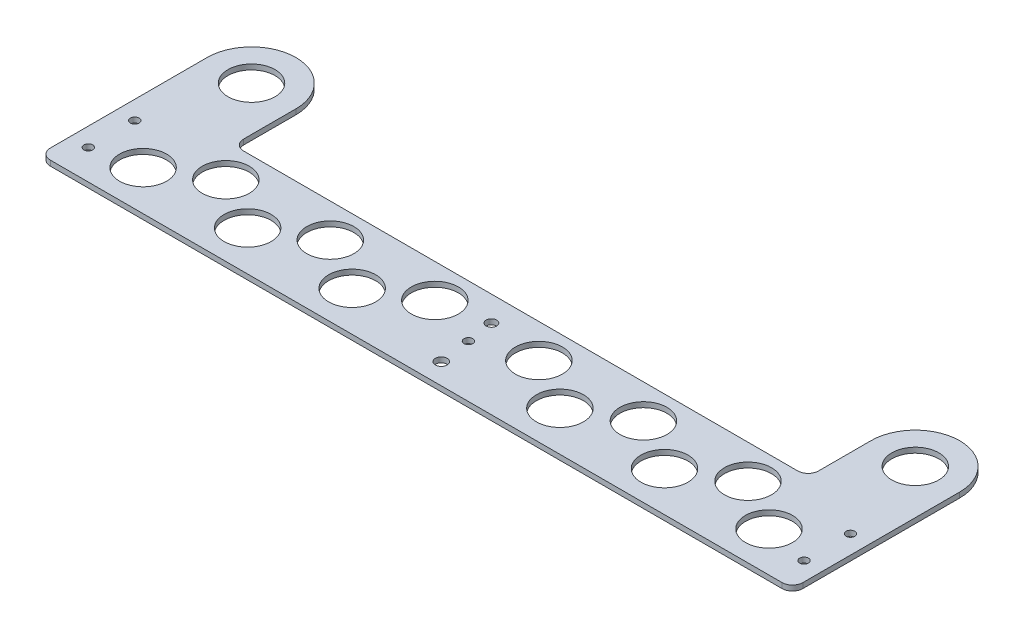
ISO-10303-21;
HEADER;
FILE_DESCRIPTION(('STEP AP214'),'2;1');
FILE_NAME('part.step','',(''),(''),'','','');
FILE_SCHEMA(('AUTOMOTIVE_DESIGN { 1 0 10303 214 1 1 1 1 }'));
ENDSEC;
DATA;
#1=APPLICATION_CONTEXT('core data for automotive mechanical design processes');
#2=APPLICATION_PROTOCOL_DEFINITION('international standard','automotive_design',2000,#1);
#3=PRODUCT_CONTEXT('',#1,'mechanical');
#4=PRODUCT('Part','Part','',(#3));
#5=PRODUCT_RELATED_PRODUCT_CATEGORY('part','',(#4));
#6=PRODUCT_DEFINITION_FORMATION('','',#4);
#7=PRODUCT_DEFINITION_CONTEXT('part definition',#1,'design');
#8=PRODUCT_DEFINITION('design','',#6,#7);
#9=PRODUCT_DEFINITION_SHAPE('','',#8);
#10=(LENGTH_UNIT() NAMED_UNIT(*) SI_UNIT(.MILLI.,.METRE.));
#11=(NAMED_UNIT(*) PLANE_ANGLE_UNIT() SI_UNIT($,.RADIAN.));
#12=(NAMED_UNIT(*) SI_UNIT($,.STERADIAN.) SOLID_ANGLE_UNIT());
#13=UNCERTAINTY_MEASURE_WITH_UNIT(LENGTH_MEASURE(1.E-05),#10,'distance_accuracy_value','');
#14=(GEOMETRIC_REPRESENTATION_CONTEXT(3) GLOBAL_UNCERTAINTY_ASSIGNED_CONTEXT((#13)) GLOBAL_UNIT_ASSIGNED_CONTEXT((#10,
#11,#12)) REPRESENTATION_CONTEXT('',''));
#15=CARTESIAN_POINT('',(0.,0.,0.));
#16=DIRECTION('',(0.,0.,1.));
#17=DIRECTION('',(1.,0.,0.));
#18=AXIS2_PLACEMENT_3D('',#15,#16,#17);
#19=CARTESIAN_POINT('',(0.,3.175,0.));
#20=DIRECTION('',(0.,1.,0.));
#21=DIRECTION('',(0.,0.,1.));
#22=AXIS2_PLACEMENT_3D('',#19,#20,#21);
#23=PLANE('',#22);
#24=CARTESIAN_POINT('',(11.5016714137539,3.175,77.3671745201341));
#25=DIRECTION('',(0.,1.,0.));
#26=DIRECTION('',(0.,0.,1.));
#27=AXIS2_PLACEMENT_3D('',#24,#25,#26);
#28=CIRCLE('',#27,14.2875);
#29=CARTESIAN_POINT('',(11.5016714137539,3.175,91.6546745201341));
#30=VERTEX_POINT('',#29);
#31=EDGE_CURVE('E357',#30,#30,#28,.T.);
#32=ORIENTED_EDGE('',*,*,#31,.F.);
#33=EDGE_LOOP('',(#32));
#34=FACE_BOUND('',#33,.T.);
#35=CARTESIAN_POINT('',(43.0029040562943,3.175,58.6359686154765));
#36=DIRECTION('',(0.,1.,0.));
#37=DIRECTION('',(0.,0.,1.));
#38=AXIS2_PLACEMENT_3D('',#35,#36,#37);
#39=CIRCLE('',#38,14.2875);
#40=CARTESIAN_POINT('',(43.0029040562943,3.175,72.9234686154765));
#41=VERTEX_POINT('',#40);
#42=EDGE_CURVE('E369',#41,#41,#39,.T.);
#43=ORIENTED_EDGE('',*,*,#42,.F.);
#44=EDGE_LOOP('',(#43));
#45=FACE_BOUND('',#44,.T.);
#46=CARTESIAN_POINT('',(75.0016714137539,3.175,77.3671745201341));
#47=DIRECTION('',(0.,1.,0.));
#48=DIRECTION('',(0.,0.,1.));
#49=AXIS2_PLACEMENT_3D('',#46,#47,#48);
#50=CIRCLE('',#49,14.2875);
#51=CARTESIAN_POINT('',(75.0016714137539,3.175,91.6546745201341));
#52=VERTEX_POINT('',#51);
#53=EDGE_CURVE('E375',#52,#52,#50,.T.);
#54=ORIENTED_EDGE('',*,*,#53,.F.);
#55=EDGE_LOOP('',(#54));
#56=FACE_BOUND('',#55,.T.);
#57=CARTESIAN_POINT('',(106.502904056294,3.175,58.6359686154765));
#58=DIRECTION('',(0.,1.,0.));
#59=DIRECTION('',(0.,0.,1.));
#60=AXIS2_PLACEMENT_3D('',#57,#58,#59);
#61=CIRCLE('',#60,14.2875);
#62=CARTESIAN_POINT('',(106.502904056294,3.175,72.9234686154765));
#63=VERTEX_POINT('',#62);
#64=EDGE_CURVE('E381',#63,#63,#61,.T.);
#65=ORIENTED_EDGE('',*,*,#64,.F.);
#66=EDGE_LOOP('',(#65));
#67=FACE_BOUND('',#66,.T.);
#68=CARTESIAN_POINT('',(138.501671413754,3.175,77.3671745201341));
#69=DIRECTION('',(0.,1.,0.));
#70=DIRECTION('',(0.,0.,1.));
#71=AXIS2_PLACEMENT_3D('',#68,#69,#70);
#72=CIRCLE('',#71,14.2875);
#73=CARTESIAN_POINT('',(138.501671413754,3.175,91.6546745201341));
#74=VERTEX_POINT('',#73);
#75=EDGE_CURVE('E387',#74,#74,#72,.T.);
#76=ORIENTED_EDGE('',*,*,#75,.F.);
#77=EDGE_LOOP('',(#76));
#78=FACE_BOUND('',#77,.T.);
#79=CARTESIAN_POINT('',(170.002904056294,3.175,58.6359686154765));
#80=DIRECTION('',(0.,1.,0.));
#81=DIRECTION('',(0.,0.,1.));
#82=AXIS2_PLACEMENT_3D('',#79,#80,#81);
#83=CIRCLE('',#82,14.2875);
#84=CARTESIAN_POINT('',(170.002904056294,3.175,72.9234686154765));
#85=VERTEX_POINT('',#84);
#86=EDGE_CURVE('E393',#85,#85,#83,.T.);
#87=ORIENTED_EDGE('',*,*,#86,.F.);
#88=EDGE_LOOP('',(#87));
#89=FACE_BOUND('',#88,.T.);
#90=CARTESIAN_POINT('',(233.222095943706,3.175,58.6359686154765));
#91=DIRECTION('',(0.,1.,0.));
#92=DIRECTION('',(0.,0.,-1.));
#93=AXIS2_PLACEMENT_3D('',#90,#91,#92);
#94=CIRCLE('',#93,14.2875);
#95=CARTESIAN_POINT('',(233.222095943706,3.175,44.3484686154765));
#96=VERTEX_POINT('',#95);
#97=EDGE_CURVE('E399',#96,#96,#94,.T.);
#98=ORIENTED_EDGE('',*,*,#97,.F.);
#99=EDGE_LOOP('',(#98));
#100=FACE_BOUND('',#99,.T.);
#101=CARTESIAN_POINT('',(264.723328586246,3.175,77.3671745201341));
#102=DIRECTION('',(0.,1.,0.));
#103=DIRECTION('',(0.,0.,-1.));
#104=AXIS2_PLACEMENT_3D('',#101,#102,#103);
#105=CIRCLE('',#104,14.2875);
#106=CARTESIAN_POINT('',(264.723328586246,3.175,63.079674520134));
#107=VERTEX_POINT('',#106);
#108=EDGE_CURVE('E405',#107,#107,#105,.T.);
#109=ORIENTED_EDGE('',*,*,#108,.F.);
#110=EDGE_LOOP('',(#109));
#111=FACE_BOUND('',#110,.T.);
#112=CARTESIAN_POINT('',(296.722095943706,3.175,58.6359686154765));
#113=DIRECTION('',(0.,1.,0.));
#114=DIRECTION('',(0.,0.,-1.));
#115=AXIS2_PLACEMENT_3D('',#112,#113,#114);
#116=CIRCLE('',#115,14.2875000000001);
#117=CARTESIAN_POINT('',(296.722095943706,3.175,44.3484686154764));
#118=VERTEX_POINT('',#117);
#119=EDGE_CURVE('E411',#118,#118,#116,.T.);
#120=ORIENTED_EDGE('',*,*,#119,.F.);
#121=EDGE_LOOP('',(#120));
#122=FACE_BOUND('',#121,.T.);
#123=CARTESIAN_POINT('',(328.223328586246,3.175,77.3671745201341));
#124=DIRECTION('',(0.,1.,0.));
#125=DIRECTION('',(0.,0.,-1.));
#126=AXIS2_PLACEMENT_3D('',#123,#124,#125);
#127=CIRCLE('',#126,14.2875);
#128=CARTESIAN_POINT('',(328.223328586246,3.175,63.079674520134));
#129=VERTEX_POINT('',#128);
#130=EDGE_CURVE('E417',#129,#129,#127,.T.);
#131=ORIENTED_EDGE('',*,*,#130,.F.);
#132=EDGE_LOOP('',(#131));
#133=FACE_BOUND('',#132,.T.);
#134=CARTESIAN_POINT('',(360.222095943706,3.175,58.6359686154765));
#135=DIRECTION('',(0.,1.,0.));
#136=DIRECTION('',(0.,0.,-1.));
#137=AXIS2_PLACEMENT_3D('',#134,#135,#136);
#138=CIRCLE('',#137,14.2875000000001);
#139=CARTESIAN_POINT('',(360.222095943706,3.175,44.3484686154764));
#140=VERTEX_POINT('',#139);
#141=EDGE_CURVE('E423',#140,#140,#138,.T.);
#142=ORIENTED_EDGE('',*,*,#141,.F.);
#143=EDGE_LOOP('',(#142));
#144=FACE_BOUND('',#143,.T.);
#145=CARTESIAN_POINT('',(391.723328586246,3.175,77.3671745201341));
#146=DIRECTION('',(0.,1.,0.));
#147=DIRECTION('',(0.,0.,-1.));
#148=AXIS2_PLACEMENT_3D('',#145,#146,#147);
#149=CIRCLE('',#148,14.2875);
#150=CARTESIAN_POINT('',(391.723328586246,3.175,63.0796745201341));
#151=VERTEX_POINT('',#150);
#152=EDGE_CURVE('E429',#151,#151,#149,.T.);
#153=ORIENTED_EDGE('',*,*,#152,.F.);
#154=EDGE_LOOP('',(#153));
#155=FACE_BOUND('',#154,.T.);
#156=CARTESIAN_POINT('',(201.6125,3.175,69.85));
#157=DIRECTION('',(0.,1.,0.));
#158=DIRECTION('',(0.,0.,1.));
#159=AXIS2_PLACEMENT_3D('',#156,#157,#158);
#160=CIRCLE('',#159,2.66700000000002);
#161=CARTESIAN_POINT('',(201.6125,3.175,72.517));
#162=VERTEX_POINT('',#161);
#163=EDGE_CURVE('E361',#162,#162,#160,.T.);
#164=ORIENTED_EDGE('',*,*,#163,.F.);
#165=EDGE_LOOP('',(#164));
#166=FACE_BOUND('',#165,.T.);
#167=CARTESIAN_POINT('',(419.004743521478,3.175,55.1590300441376));
#168=DIRECTION('',(0.,1.,0.));
#169=DIRECTION('',(0.,0.,-1.));
#170=AXIS2_PLACEMENT_3D('',#167,#168,#169);
#171=CIRCLE('',#170,2.66699999999997);
#172=CARTESIAN_POINT('',(419.004743521478,3.175,52.4920300441376));
#173=VERTEX_POINT('',#172);
#174=EDGE_CURVE('E443',#173,#173,#171,.T.);
#175=ORIENTED_EDGE('',*,*,#174,.F.);
#176=EDGE_LOOP('',(#175));
#177=FACE_BOUND('',#176,.T.);
#178=CARTESIAN_POINT('',(-15.7797435214775,3.175,83.3714931313807));
#179=DIRECTION('',(0.,1.,0.));
#180=DIRECTION('',(0.,0.,1.));
#181=AXIS2_PLACEMENT_3D('',#178,#179,#180);
#182=CIRCLE('',#181,2.667);
#183=CARTESIAN_POINT('',(-15.7797435214775,3.175,86.0384931313807));
#184=VERTEX_POINT('',#183);
#185=EDGE_CURVE('E442',#184,#184,#182,.T.);
#186=ORIENTED_EDGE('',*,*,#185,.F.);
#187=EDGE_LOOP('',(#186));
#188=FACE_BOUND('',#187,.T.);
#189=CARTESIAN_POINT('',(419.004743521478,3.175,83.3714931313807));
#190=DIRECTION('',(0.,1.,0.));
#191=DIRECTION('',(0.,0.,-1.));
#192=AXIS2_PLACEMENT_3D('',#189,#190,#191);
#193=CIRCLE('',#192,2.66699999999997);
#194=CARTESIAN_POINT('',(419.004743521478,3.175,80.7044931313807));
#195=VERTEX_POINT('',#194);
#196=EDGE_CURVE('E436',#195,#195,#193,.T.);
#197=ORIENTED_EDGE('',*,*,#196,.F.);
#198=EDGE_LOOP('',(#197));
#199=FACE_BOUND('',#198,.T.);
#200=CARTESIAN_POINT('',(-15.7797435214775,3.175,55.1590300441376));
#201=DIRECTION('',(0.,1.,0.));
#202=DIRECTION('',(0.,0.,1.));
#203=AXIS2_PLACEMENT_3D('',#200,#201,#202);
#204=CIRCLE('',#203,2.667);
#205=CARTESIAN_POINT('',(-15.7797435214775,3.175,57.8260300441376));
#206=VERTEX_POINT('',#205);
#207=EDGE_CURVE('E450',#206,#206,#204,.T.);
#208=ORIENTED_EDGE('',*,*,#207,.F.);
#209=EDGE_LOOP('',(#208));
#210=FACE_BOUND('',#209,.T.);
#211=CARTESIAN_POINT('',(204.1525,3.175,88.9));
#212=DIRECTION('',(0.,1.,0.));
#213=DIRECTION('',(0.,0.,1.));
#214=AXIS2_PLACEMENT_3D('',#211,#212,#213);
#215=CIRCLE('',#214,3.55599999999998);
#216=CARTESIAN_POINT('',(204.1525,3.175,92.456));
#217=VERTEX_POINT('',#216);
#218=EDGE_CURVE('E461',#217,#217,#215,.T.);
#219=ORIENTED_EDGE('',*,*,#218,.F.);
#220=EDGE_LOOP('',(#219));
#221=FACE_BOUND('',#220,.T.);
#222=CARTESIAN_POINT('',(199.0725,3.175,53.34));
#223=DIRECTION('',(0.,1.,0.));
#224=DIRECTION('',(0.,0.,1.));
#225=AXIS2_PLACEMENT_3D('',#222,#223,#224);
#226=CIRCLE('',#225,3.175);
#227=CARTESIAN_POINT('',(199.0725,3.175,56.515));
#228=VERTEX_POINT('',#227);
#229=EDGE_CURVE('E460',#228,#228,#226,.T.);
#230=ORIENTED_EDGE('',*,*,#229,.F.);
#231=EDGE_LOOP('',(#230));
#232=FACE_BOUND('',#231,.T.);
#233=CARTESIAN_POINT('',(0.,3.175,0.));
#234=DIRECTION('',(0.,1.,0.));
#235=DIRECTION('',(0.,0.,1.));
#236=AXIS2_PLACEMENT_3D('',#233,#234,#235);
#237=CIRCLE('',#236,14.2875);
#238=CARTESIAN_POINT('',(0.,3.175,14.2875));
#239=VERTEX_POINT('',#238);
#240=EDGE_CURVE('E164',#239,#239,#237,.T.);
#241=ORIENTED_EDGE('',*,*,#240,.F.);
#242=EDGE_LOOP('',(#241));
#243=FACE_BOUND('',#242,.T.);
#244=CARTESIAN_POINT('',(0.,3.175,0.));
#245=DIRECTION('',(0.,1.,0.));
#246=DIRECTION('',(0.,0.,1.));
#247=AXIS2_PLACEMENT_3D('',#244,#245,#246);
#248=CIRCLE('',#247,26.9875);
#249=CARTESIAN_POINT('',(26.9875,3.175,0.));
#250=VERTEX_POINT('',#249);
#251=CARTESIAN_POINT('',(-26.9875,3.175,0.));
#252=VERTEX_POINT('',#251);
#253=EDGE_CURVE('E183',#250,#252,#248,.T.);
#254=ORIENTED_EDGE('',*,*,#253,.T.);
#255=DIRECTION('',(0.,0.,1.));
#256=VECTOR('',#255,1.);
#257=CARTESIAN_POINT('',(-26.9875,3.175,0.));
#258=LINE('',#257,#256);
#259=CARTESIAN_POINT('',(-26.9875,3.175,95.25));
#260=VERTEX_POINT('',#259);
#261=EDGE_CURVE('E111',#252,#260,#258,.T.);
#262=ORIENTED_EDGE('',*,*,#261,.T.);
#263=CARTESIAN_POINT('',(-20.6375,3.175,95.25));
#264=DIRECTION('',(0.,1.,0.));
#265=DIRECTION('',(0.,0.,1.));
#266=AXIS2_PLACEMENT_3D('',#263,#264,#265);
#267=CIRCLE('',#266,6.35);
#268=CARTESIAN_POINT('',(-20.6375,3.175,101.6));
#269=VERTEX_POINT('',#268);
#270=EDGE_CURVE('E210',#260,#269,#267,.T.);
#271=ORIENTED_EDGE('',*,*,#270,.T.);
#272=DIRECTION('',(1.,0.,0.));
#273=VECTOR('',#272,1.);
#274=CARTESIAN_POINT('',(423.8625,3.175,101.6));
#275=LINE('',#274,#273);
#276=CARTESIAN_POINT('',(423.8625,3.175,101.6));
#277=VERTEX_POINT('',#276);
#278=EDGE_CURVE('E229',#269,#277,#275,.T.);
#279=ORIENTED_EDGE('',*,*,#278,.T.);
#280=CARTESIAN_POINT('',(423.8625,3.175,95.2499999999999));
#281=DIRECTION('',(0.,1.,0.));
#282=DIRECTION('',(0.,0.,-1.));
#283=AXIS2_PLACEMENT_3D('',#280,#281,#282);
#284=CIRCLE('',#283,6.35000000000001);
#285=CARTESIAN_POINT('',(430.2125,3.175,95.2499999999999));
#286=VERTEX_POINT('',#285);
#287=EDGE_CURVE('E226',#277,#286,#284,.T.);
#288=ORIENTED_EDGE('',*,*,#287,.T.);
#289=DIRECTION('',(0.,0.,-1.));
#290=VECTOR('',#289,1.);
#291=CARTESIAN_POINT('',(430.2125,3.175,0.));
#292=LINE('',#291,#290);
#293=CARTESIAN_POINT('',(430.2125,3.175,0.));
#294=VERTEX_POINT('',#293);
#295=EDGE_CURVE('E228',#286,#294,#292,.T.);
#296=ORIENTED_EDGE('',*,*,#295,.T.);
#297=CARTESIAN_POINT('',(403.225,3.175,0.));
#298=DIRECTION('',(0.,1.,0.));
#299=DIRECTION('',(0.,0.,1.));
#300=AXIS2_PLACEMENT_3D('',#297,#298,#299);
#301=CIRCLE('',#300,26.9875000000001);
#302=CARTESIAN_POINT('',(376.2375,3.175,0.));
#303=VERTEX_POINT('',#302);
#304=EDGE_CURVE('E231',#294,#303,#301,.T.);
#305=ORIENTED_EDGE('',*,*,#304,.T.);
#306=DIRECTION('',(0.,0.,1.));
#307=VECTOR('',#306,1.);
#308=CARTESIAN_POINT('',(376.2375,3.175,0.));
#309=LINE('',#308,#307);
#310=CARTESIAN_POINT('',(376.2375,3.175,31.75));
#311=VERTEX_POINT('',#310);
#312=EDGE_CURVE('E237',#303,#311,#309,.T.);
#313=ORIENTED_EDGE('',*,*,#312,.T.);
#314=CARTESIAN_POINT('',(369.8875,3.175,31.75));
#315=DIRECTION('',(0.,-1.,0.));
#316=DIRECTION('',(0.,0.,-1.));
#317=AXIS2_PLACEMENT_3D('',#314,#315,#316);
#318=CIRCLE('',#317,6.35000000000001);
#319=CARTESIAN_POINT('',(369.8875,3.175,38.1));
#320=VERTEX_POINT('',#319);
#321=EDGE_CURVE('E142',#311,#320,#318,.T.);
#322=ORIENTED_EDGE('',*,*,#321,.T.);
#323=DIRECTION('',(-1.,0.,0.));
#324=VECTOR('',#323,1.);
#325=CARTESIAN_POINT('',(369.8875,3.175,38.1));
#326=LINE('',#325,#324);
#327=CARTESIAN_POINT('',(33.3375,3.175,38.1));
#328=VERTEX_POINT('',#327);
#329=EDGE_CURVE('E136',#320,#328,#326,.T.);
#330=ORIENTED_EDGE('',*,*,#329,.T.);
#331=CARTESIAN_POINT('',(33.3375,3.175,31.75));
#332=DIRECTION('',(0.,-1.,0.));
#333=DIRECTION('',(0.,0.,1.));
#334=AXIS2_PLACEMENT_3D('',#331,#332,#333);
#335=CIRCLE('',#334,6.35000000000001);
#336=CARTESIAN_POINT('',(26.9875,3.175,31.75));
#337=VERTEX_POINT('',#336);
#338=EDGE_CURVE('E140',#328,#337,#335,.T.);
#339=ORIENTED_EDGE('',*,*,#338,.T.);
#340=DIRECTION('',(0.,0.,-1.));
#341=VECTOR('',#340,1.);
#342=CARTESIAN_POINT('',(26.9875,3.175,0.));
#343=LINE('',#342,#341);
#344=EDGE_CURVE('E56',#337,#250,#343,.T.);
#345=ORIENTED_EDGE('',*,*,#344,.T.);
#346=EDGE_LOOP('',(#254,#262,#271,#279,#288,#296,#305,#313,#322,#330,#339,#345));
#347=FACE_BOUND('',#346,.T.);
#348=CARTESIAN_POINT('',(403.225,3.175,0.));
#349=DIRECTION('',(0.,1.,0.));
#350=DIRECTION('',(0.,0.,1.));
#351=AXIS2_PLACEMENT_3D('',#348,#349,#350);
#352=CIRCLE('',#351,14.2875);
#353=CARTESIAN_POINT('',(403.225,3.175,14.2875));
#354=VERTEX_POINT('',#353);
#355=EDGE_CURVE('E473',#354,#354,#352,.T.);
#356=ORIENTED_EDGE('',*,*,#355,.F.);
#357=EDGE_LOOP('',(#356));
#358=FACE_BOUND('',#357,.T.);
#359=ADVANCED_FACE('F39',(#34,#45,#56,#67,#78,#89,#100,#111,#122,#133,#144,#155,#166,#177,#188,
#199,#210,#221,#232,#243,#347,#358),#23,.T.);
#360=CARTESIAN_POINT('',(0.,0.,0.));
#361=DIRECTION('',(0.,1.,0.));
#362=DIRECTION('',(0.,0.,1.));
#363=AXIS2_PLACEMENT_3D('',#360,#361,#362);
#364=PLANE('',#363);
#365=CARTESIAN_POINT('',(11.5016714137539,0.,77.3671745201341));
#366=DIRECTION('',(0.,1.,0.));
#367=DIRECTION('',(0.,0.,1.));
#368=AXIS2_PLACEMENT_3D('',#365,#366,#367);
#369=CIRCLE('',#368,14.2875);
#370=CARTESIAN_POINT('',(11.5016714137539,0.,91.6546745201341));
#371=VERTEX_POINT('',#370);
#372=EDGE_CURVE('E360',#371,#371,#369,.F.);
#373=ORIENTED_EDGE('',*,*,#372,.F.);
#374=EDGE_LOOP('',(#373));
#375=FACE_BOUND('',#374,.T.);
#376=CARTESIAN_POINT('',(43.0029040562943,0.,58.6359686154765));
#377=DIRECTION('',(0.,1.,0.));
#378=DIRECTION('',(0.,0.,1.));
#379=AXIS2_PLACEMENT_3D('',#376,#377,#378);
#380=CIRCLE('',#379,14.2875);
#381=CARTESIAN_POINT('',(43.0029040562943,0.,72.9234686154765));
#382=VERTEX_POINT('',#381);
#383=EDGE_CURVE('E366',#382,#382,#380,.F.);
#384=ORIENTED_EDGE('',*,*,#383,.F.);
#385=EDGE_LOOP('',(#384));
#386=FACE_BOUND('',#385,.T.);
#387=CARTESIAN_POINT('',(75.0016714137539,0.,77.3671745201341));
#388=DIRECTION('',(0.,1.,0.));
#389=DIRECTION('',(0.,0.,1.));
#390=AXIS2_PLACEMENT_3D('',#387,#388,#389);
#391=CIRCLE('',#390,14.2875);
#392=CARTESIAN_POINT('',(75.0016714137539,0.,91.6546745201341));
#393=VERTEX_POINT('',#392);
#394=EDGE_CURVE('E372',#393,#393,#391,.F.);
#395=ORIENTED_EDGE('',*,*,#394,.F.);
#396=EDGE_LOOP('',(#395));
#397=FACE_BOUND('',#396,.T.);
#398=CARTESIAN_POINT('',(106.502904056294,0.,58.6359686154765));
#399=DIRECTION('',(0.,1.,0.));
#400=DIRECTION('',(0.,0.,1.));
#401=AXIS2_PLACEMENT_3D('',#398,#399,#400);
#402=CIRCLE('',#401,14.2875);
#403=CARTESIAN_POINT('',(106.502904056294,0.,72.9234686154765));
#404=VERTEX_POINT('',#403);
#405=EDGE_CURVE('E378',#404,#404,#402,.F.);
#406=ORIENTED_EDGE('',*,*,#405,.F.);
#407=EDGE_LOOP('',(#406));
#408=FACE_BOUND('',#407,.T.);
#409=CARTESIAN_POINT('',(138.501671413754,0.,77.3671745201341));
#410=DIRECTION('',(0.,1.,0.));
#411=DIRECTION('',(0.,0.,1.));
#412=AXIS2_PLACEMENT_3D('',#409,#410,#411);
#413=CIRCLE('',#412,14.2875);
#414=CARTESIAN_POINT('',(138.501671413754,0.,91.6546745201341));
#415=VERTEX_POINT('',#414);
#416=EDGE_CURVE('E384',#415,#415,#413,.F.);
#417=ORIENTED_EDGE('',*,*,#416,.F.);
#418=EDGE_LOOP('',(#417));
#419=FACE_BOUND('',#418,.T.);
#420=CARTESIAN_POINT('',(170.002904056294,0.,58.6359686154765));
#421=DIRECTION('',(0.,1.,0.));
#422=DIRECTION('',(0.,0.,1.));
#423=AXIS2_PLACEMENT_3D('',#420,#421,#422);
#424=CIRCLE('',#423,14.2875);
#425=CARTESIAN_POINT('',(170.002904056294,0.,72.9234686154765));
#426=VERTEX_POINT('',#425);
#427=EDGE_CURVE('E390',#426,#426,#424,.F.);
#428=ORIENTED_EDGE('',*,*,#427,.F.);
#429=EDGE_LOOP('',(#428));
#430=FACE_BOUND('',#429,.T.);
#431=CARTESIAN_POINT('',(233.222095943706,0.,58.6359686154765));
#432=DIRECTION('',(0.,1.,0.));
#433=DIRECTION('',(0.,0.,1.));
#434=AXIS2_PLACEMENT_3D('',#431,#432,#433);
#435=CIRCLE('',#434,14.2875);
#436=CARTESIAN_POINT('',(233.222095943706,0.,72.9234686154765));
#437=VERTEX_POINT('',#436);
#438=EDGE_CURVE('E396',#437,#437,#435,.F.);
#439=ORIENTED_EDGE('',*,*,#438,.F.);
#440=EDGE_LOOP('',(#439));
#441=FACE_BOUND('',#440,.T.);
#442=CARTESIAN_POINT('',(264.723328586246,0.,77.3671745201341));
#443=DIRECTION('',(0.,1.,0.));
#444=DIRECTION('',(0.,0.,1.));
#445=AXIS2_PLACEMENT_3D('',#442,#443,#444);
#446=CIRCLE('',#445,14.2875);
#447=CARTESIAN_POINT('',(264.723328586246,0.,91.6546745201341));
#448=VERTEX_POINT('',#447);
#449=EDGE_CURVE('E402',#448,#448,#446,.F.);
#450=ORIENTED_EDGE('',*,*,#449,.F.);
#451=EDGE_LOOP('',(#450));
#452=FACE_BOUND('',#451,.T.);
#453=CARTESIAN_POINT('',(296.722095943706,0.,58.6359686154765));
#454=DIRECTION('',(0.,1.,0.));
#455=DIRECTION('',(0.,0.,1.));
#456=AXIS2_PLACEMENT_3D('',#453,#454,#455);
#457=CIRCLE('',#456,14.2875000000001);
#458=CARTESIAN_POINT('',(296.722095943706,0.,72.9234686154766));
#459=VERTEX_POINT('',#458);
#460=EDGE_CURVE('E408',#459,#459,#457,.F.);
#461=ORIENTED_EDGE('',*,*,#460,.F.);
#462=EDGE_LOOP('',(#461));
#463=FACE_BOUND('',#462,.T.);
#464=CARTESIAN_POINT('',(328.223328586246,0.,77.3671745201341));
#465=DIRECTION('',(0.,1.,0.));
#466=DIRECTION('',(0.,0.,1.));
#467=AXIS2_PLACEMENT_3D('',#464,#465,#466);
#468=CIRCLE('',#467,14.2875);
#469=CARTESIAN_POINT('',(328.223328586246,0.,91.6546745201341));
#470=VERTEX_POINT('',#469);
#471=EDGE_CURVE('E414',#470,#470,#468,.F.);
#472=ORIENTED_EDGE('',*,*,#471,.F.);
#473=EDGE_LOOP('',(#472));
#474=FACE_BOUND('',#473,.T.);
#475=CARTESIAN_POINT('',(360.222095943706,0.,58.6359686154765));
#476=DIRECTION('',(0.,1.,0.));
#477=DIRECTION('',(0.,0.,1.));
#478=AXIS2_PLACEMENT_3D('',#475,#476,#477);
#479=CIRCLE('',#478,14.2875000000001);
#480=CARTESIAN_POINT('',(360.222095943706,0.,72.9234686154766));
#481=VERTEX_POINT('',#480);
#482=EDGE_CURVE('E420',#481,#481,#479,.F.);
#483=ORIENTED_EDGE('',*,*,#482,.F.);
#484=EDGE_LOOP('',(#483));
#485=FACE_BOUND('',#484,.T.);
#486=CARTESIAN_POINT('',(391.723328586246,0.,77.3671745201341));
#487=DIRECTION('',(0.,1.,0.));
#488=DIRECTION('',(0.,0.,1.));
#489=AXIS2_PLACEMENT_3D('',#486,#487,#488);
#490=CIRCLE('',#489,14.2875);
#491=CARTESIAN_POINT('',(391.723328586246,0.,91.6546745201341));
#492=VERTEX_POINT('',#491);
#493=EDGE_CURVE('E426',#492,#492,#490,.F.);
#494=ORIENTED_EDGE('',*,*,#493,.F.);
#495=EDGE_LOOP('',(#494));
#496=FACE_BOUND('',#495,.T.);
#497=CARTESIAN_POINT('',(201.6125,0.,69.85));
#498=DIRECTION('',(0.,1.,0.));
#499=DIRECTION('',(0.,0.,1.));
#500=AXIS2_PLACEMENT_3D('',#497,#498,#499);
#501=CIRCLE('',#500,2.66700000000002);
#502=CARTESIAN_POINT('',(201.6125,0.,72.517));
#503=VERTEX_POINT('',#502);
#504=EDGE_CURVE('E364',#503,#503,#501,.F.);
#505=ORIENTED_EDGE('',*,*,#504,.F.);
#506=EDGE_LOOP('',(#505));
#507=FACE_BOUND('',#506,.T.);
#508=CARTESIAN_POINT('',(419.004743521478,0.,55.1590300441376));
#509=DIRECTION('',(0.,1.,0.));
#510=DIRECTION('',(0.,0.,1.));
#511=AXIS2_PLACEMENT_3D('',#508,#509,#510);
#512=CIRCLE('',#511,2.66699999999997);
#513=CARTESIAN_POINT('',(419.004743521478,0.,57.8260300441375));
#514=VERTEX_POINT('',#513);
#515=EDGE_CURVE('E446',#514,#514,#512,.F.);
#516=ORIENTED_EDGE('',*,*,#515,.F.);
#517=EDGE_LOOP('',(#516));
#518=FACE_BOUND('',#517,.T.);
#519=CARTESIAN_POINT('',(-15.7797435214775,0.,83.3714931313807));
#520=DIRECTION('',(0.,1.,0.));
#521=DIRECTION('',(0.,0.,1.));
#522=AXIS2_PLACEMENT_3D('',#519,#520,#521);
#523=CIRCLE('',#522,2.667);
#524=CARTESIAN_POINT('',(-15.7797435214775,0.,86.0384931313807));
#525=VERTEX_POINT('',#524);
#526=EDGE_CURVE('E447',#525,#525,#523,.F.);
#527=ORIENTED_EDGE('',*,*,#526,.F.);
#528=EDGE_LOOP('',(#527));
#529=FACE_BOUND('',#528,.T.);
#530=CARTESIAN_POINT('',(419.004743521478,0.,83.3714931313807));
#531=DIRECTION('',(0.,1.,0.));
#532=DIRECTION('',(0.,0.,1.));
#533=AXIS2_PLACEMENT_3D('',#530,#531,#532);
#534=CIRCLE('',#533,2.66699999999997);
#535=CARTESIAN_POINT('',(419.004743521478,0.,86.0384931313806));
#536=VERTEX_POINT('',#535);
#537=EDGE_CURVE('E439',#536,#536,#534,.F.);
#538=ORIENTED_EDGE('',*,*,#537,.F.);
#539=EDGE_LOOP('',(#538));
#540=FACE_BOUND('',#539,.T.);
#541=CARTESIAN_POINT('',(-15.7797435214775,0.,55.1590300441376));
#542=DIRECTION('',(0.,1.,0.));
#543=DIRECTION('',(0.,0.,1.));
#544=AXIS2_PLACEMENT_3D('',#541,#542,#543);
#545=CIRCLE('',#544,2.667);
#546=CARTESIAN_POINT('',(-15.7797435214775,0.,57.8260300441376));
#547=VERTEX_POINT('',#546);
#548=EDGE_CURVE('E457',#547,#547,#545,.F.);
#549=ORIENTED_EDGE('',*,*,#548,.F.);
#550=EDGE_LOOP('',(#549));
#551=FACE_BOUND('',#550,.T.);
#552=CARTESIAN_POINT('',(204.1525,0.,88.9));
#553=DIRECTION('',(0.,1.,0.));
#554=DIRECTION('',(0.,0.,1.));
#555=AXIS2_PLACEMENT_3D('',#552,#553,#554);
#556=CIRCLE('',#555,3.55599999999998);
#557=CARTESIAN_POINT('',(204.1525,0.,92.456));
#558=VERTEX_POINT('',#557);
#559=EDGE_CURVE('E464',#558,#558,#556,.F.);
#560=ORIENTED_EDGE('',*,*,#559,.F.);
#561=EDGE_LOOP('',(#560));
#562=FACE_BOUND('',#561,.T.);
#563=CARTESIAN_POINT('',(199.0725,0.,53.34));
#564=DIRECTION('',(0.,1.,0.));
#565=DIRECTION('',(0.,0.,1.));
#566=AXIS2_PLACEMENT_3D('',#563,#564,#565);
#567=CIRCLE('',#566,3.175);
#568=CARTESIAN_POINT('',(199.0725,0.,56.515));
#569=VERTEX_POINT('',#568);
#570=EDGE_CURVE('E465',#569,#569,#567,.F.);
#571=ORIENTED_EDGE('',*,*,#570,.F.);
#572=EDGE_LOOP('',(#571));
#573=FACE_BOUND('',#572,.T.);
#574=CARTESIAN_POINT('',(0.,0.,0.));
#575=DIRECTION('',(0.,1.,0.));
#576=DIRECTION('',(0.,0.,1.));
#577=AXIS2_PLACEMENT_3D('',#574,#575,#576);
#578=CIRCLE('',#577,26.9875);
#579=CARTESIAN_POINT('',(26.9875,0.,0.));
#580=VERTEX_POINT('',#579);
#581=CARTESIAN_POINT('',(-26.9875,0.,0.));
#582=VERTEX_POINT('',#581);
#583=EDGE_CURVE('E160',#580,#582,#578,.T.);
#584=ORIENTED_EDGE('',*,*,#583,.F.);
#585=DIRECTION('',(0.,0.,-1.));
#586=VECTOR('',#585,1.);
#587=CARTESIAN_POINT('',(26.9875,0.,0.));
#588=LINE('',#587,#586);
#589=CARTESIAN_POINT('',(26.9875,0.,31.75));
#590=VERTEX_POINT('',#589);
#591=EDGE_CURVE('E103',#590,#580,#588,.T.);
#592=ORIENTED_EDGE('',*,*,#591,.F.);
#593=CARTESIAN_POINT('',(33.3375,0.,31.75));
#594=DIRECTION('',(0.,-1.,0.));
#595=DIRECTION('',(0.,0.,1.));
#596=AXIS2_PLACEMENT_3D('',#593,#594,#595);
#597=CIRCLE('',#596,6.35000000000001);
#598=CARTESIAN_POINT('',(33.3375,0.,38.1));
#599=VERTEX_POINT('',#598);
#600=EDGE_CURVE('E97',#599,#590,#597,.T.);
#601=ORIENTED_EDGE('',*,*,#600,.F.);
#602=DIRECTION('',(-1.,0.,0.));
#603=VECTOR('',#602,1.);
#604=CARTESIAN_POINT('',(369.8875,0.,38.1));
#605=LINE('',#604,#603);
#606=CARTESIAN_POINT('',(369.8875,0.,38.1));
#607=VERTEX_POINT('',#606);
#608=EDGE_CURVE('E150',#607,#599,#605,.T.);
#609=ORIENTED_EDGE('',*,*,#608,.F.);
#610=CARTESIAN_POINT('',(369.8875,0.,31.75));
#611=DIRECTION('',(0.,-1.,0.));
#612=DIRECTION('',(0.,0.,-1.));
#613=AXIS2_PLACEMENT_3D('',#610,#611,#612);
#614=CIRCLE('',#613,6.35000000000001);
#615=CARTESIAN_POINT('',(376.2375,0.,31.75));
#616=VERTEX_POINT('',#615);
#617=EDGE_CURVE('E178',#616,#607,#614,.T.);
#618=ORIENTED_EDGE('',*,*,#617,.F.);
#619=DIRECTION('',(0.,0.,1.));
#620=VECTOR('',#619,1.);
#621=CARTESIAN_POINT('',(376.2375,0.,0.));
#622=LINE('',#621,#620);
#623=CARTESIAN_POINT('',(376.2375,0.,0.));
#624=VERTEX_POINT('',#623);
#625=EDGE_CURVE('E176',#624,#616,#622,.T.);
#626=ORIENTED_EDGE('',*,*,#625,.F.);
#627=CARTESIAN_POINT('',(403.225,0.,0.));
#628=DIRECTION('',(0.,1.,0.));
#629=DIRECTION('',(0.,0.,1.));
#630=AXIS2_PLACEMENT_3D('',#627,#628,#629);
#631=CIRCLE('',#630,26.9875000000001);
#632=CARTESIAN_POINT('',(430.2125,0.,0.));
#633=VERTEX_POINT('',#632);
#634=EDGE_CURVE('E174',#633,#624,#631,.T.);
#635=ORIENTED_EDGE('',*,*,#634,.F.);
#636=DIRECTION('',(0.,0.,-1.));
#637=VECTOR('',#636,1.);
#638=CARTESIAN_POINT('',(430.2125,0.,0.));
#639=LINE('',#638,#637);
#640=CARTESIAN_POINT('',(430.2125,0.,95.2499999999999));
#641=VERTEX_POINT('',#640);
#642=EDGE_CURVE('E172',#641,#633,#639,.T.);
#643=ORIENTED_EDGE('',*,*,#642,.F.);
#644=CARTESIAN_POINT('',(423.8625,0.,95.2499999999999));
#645=DIRECTION('',(0.,1.,0.));
#646=DIRECTION('',(0.,0.,-1.));
#647=AXIS2_PLACEMENT_3D('',#644,#645,#646);
#648=CIRCLE('',#647,6.35000000000001);
#649=CARTESIAN_POINT('',(423.8625,0.,101.6));
#650=VERTEX_POINT('',#649);
#651=EDGE_CURVE('E170',#650,#641,#648,.T.);
#652=ORIENTED_EDGE('',*,*,#651,.F.);
#653=DIRECTION('',(1.,0.,0.));
#654=VECTOR('',#653,1.);
#655=CARTESIAN_POINT('',(423.8625,0.,101.6));
#656=LINE('',#655,#654);
#657=CARTESIAN_POINT('',(-20.6375,0.,101.6));
#658=VERTEX_POINT('',#657);
#659=EDGE_CURVE('E168',#658,#650,#656,.T.);
#660=ORIENTED_EDGE('',*,*,#659,.F.);
#661=CARTESIAN_POINT('',(-20.6375,0.,95.25));
#662=DIRECTION('',(0.,1.,0.));
#663=DIRECTION('',(0.,0.,1.));
#664=AXIS2_PLACEMENT_3D('',#661,#662,#663);
#665=CIRCLE('',#664,6.35);
#666=CARTESIAN_POINT('',(-26.9875,0.,95.25));
#667=VERTEX_POINT('',#666);
#668=EDGE_CURVE('E166',#667,#658,#665,.T.);
#669=ORIENTED_EDGE('',*,*,#668,.F.);
#670=DIRECTION('',(0.,0.,1.));
#671=VECTOR('',#670,1.);
#672=CARTESIAN_POINT('',(-26.9875,0.,0.));
#673=LINE('',#672,#671);
#674=EDGE_CURVE('E163',#582,#667,#673,.T.);
#675=ORIENTED_EDGE('',*,*,#674,.F.);
#676=EDGE_LOOP('',(#584,#592,#601,#609,#618,#626,#635,#643,#652,#660,#669,#675));
#677=FACE_BOUND('',#676,.T.);
#678=CARTESIAN_POINT('',(0.,0.,0.));
#679=DIRECTION('',(0.,1.,0.));
#680=DIRECTION('',(0.,0.,1.));
#681=AXIS2_PLACEMENT_3D('',#678,#679,#680);
#682=CIRCLE('',#681,14.2875);
#683=CARTESIAN_POINT('',(0.,0.,14.2875));
#684=VERTEX_POINT('',#683);
#685=EDGE_CURVE('E476',#684,#684,#682,.T.);
#686=ORIENTED_EDGE('',*,*,#685,.T.);
#687=EDGE_LOOP('',(#686));
#688=FACE_BOUND('',#687,.T.);
#689=CARTESIAN_POINT('',(403.225,0.,0.));
#690=DIRECTION('',(0.,1.,0.));
#691=DIRECTION('',(0.,0.,1.));
#692=AXIS2_PLACEMENT_3D('',#689,#690,#691);
#693=CIRCLE('',#692,14.2875);
#694=CARTESIAN_POINT('',(403.225,0.,14.2875));
#695=VERTEX_POINT('',#694);
#696=EDGE_CURVE('E468',#695,#695,#693,.T.);
#697=ORIENTED_EDGE('',*,*,#696,.T.);
#698=EDGE_LOOP('',(#697));
#699=FACE_BOUND('',#698,.T.);
#700=ADVANCED_FACE('F214',(#375,#386,#397,#408,#419,#430,#441,#452,#463,#474,#485,#496,#507,
#518,#529,#540,#551,#562,#573,#677,#688,#699),#364,.F.);
#701=CARTESIAN_POINT('',(0.,3.175,0.));
#702=DIRECTION('',(0.,-1.,0.));
#703=DIRECTION('',(0.,0.,-1.));
#704=AXIS2_PLACEMENT_3D('',#701,#702,#703);
#705=CYLINDRICAL_SURFACE('',#704,26.9875);
#706=ORIENTED_EDGE('',*,*,#583,.T.);
#707=DIRECTION('',(0.,-1.,0.));
#708=VECTOR('',#707,1.);
#709=CARTESIAN_POINT('',(-26.9875,3.175,0.));
#710=LINE('',#709,#708);
#711=EDGE_CURVE('E11',#252,#582,#710,.T.);
#712=ORIENTED_EDGE('',*,*,#711,.F.);
#713=ORIENTED_EDGE('',*,*,#253,.F.);
#714=DIRECTION('',(0.,-1.,0.));
#715=VECTOR('',#714,1.);
#716=CARTESIAN_POINT('',(26.9875,3.175,0.));
#717=LINE('',#716,#715);
#718=EDGE_CURVE('E156',#250,#580,#717,.T.);
#719=ORIENTED_EDGE('',*,*,#718,.T.);
#720=EDGE_LOOP('',(#706,#712,#713,#719));
#721=FACE_BOUND('',#720,.T.);
#722=ADVANCED_FACE('F41',(#721),#705,.T.);
#723=CARTESIAN_POINT('',(-26.9875,3.175,0.));
#724=DIRECTION('',(1.,0.,0.));
#725=DIRECTION('',(0.,0.,-1.));
#726=AXIS2_PLACEMENT_3D('',#723,#724,#725);
#727=PLANE('',#726);
#728=ORIENTED_EDGE('',*,*,#674,.T.);
#729=DIRECTION('',(0.,-1.,0.));
#730=VECTOR('',#729,1.);
#731=CARTESIAN_POINT('',(-26.9875,3.175,95.25));
#732=LINE('',#731,#730);
#733=EDGE_CURVE('E48',#260,#667,#732,.T.);
#734=ORIENTED_EDGE('',*,*,#733,.F.);
#735=ORIENTED_EDGE('',*,*,#261,.F.);
#736=ORIENTED_EDGE('',*,*,#711,.T.);
#737=EDGE_LOOP('',(#728,#734,#735,#736));
#738=FACE_BOUND('',#737,.T.);
#739=ADVANCED_FACE('F739',(#738),#727,.F.);
#740=CARTESIAN_POINT('',(-20.6375,3.175,95.25));
#741=DIRECTION('',(0.,-1.,0.));
#742=DIRECTION('',(0.,0.,-1.));
#743=AXIS2_PLACEMENT_3D('',#740,#741,#742);
#744=CYLINDRICAL_SURFACE('',#743,6.35);
#745=ORIENTED_EDGE('',*,*,#668,.T.);
#746=DIRECTION('',(0.,-1.,0.));
#747=VECTOR('',#746,1.);
#748=CARTESIAN_POINT('',(-20.6375,3.175,101.6));
#749=LINE('',#748,#747);
#750=EDGE_CURVE('E202',#269,#658,#749,.T.);
#751=ORIENTED_EDGE('',*,*,#750,.F.);
#752=ORIENTED_EDGE('',*,*,#270,.F.);
#753=ORIENTED_EDGE('',*,*,#733,.T.);
#754=EDGE_LOOP('',(#745,#751,#752,#753));
#755=FACE_BOUND('',#754,.T.);
#756=ADVANCED_FACE('F208',(#755),#744,.T.);
#757=CARTESIAN_POINT('',(423.8625,3.175,101.6));
#758=DIRECTION('',(0.,0.,-1.));
#759=DIRECTION('',(-1.,0.,0.));
#760=AXIS2_PLACEMENT_3D('',#757,#758,#759);
#761=PLANE('',#760);
#762=ORIENTED_EDGE('',*,*,#659,.T.);
#763=DIRECTION('',(0.,-1.,0.));
#764=VECTOR('',#763,1.);
#765=CARTESIAN_POINT('',(423.8625,3.175,101.6));
#766=LINE('',#765,#764);
#767=EDGE_CURVE('E199',#277,#650,#766,.T.);
#768=ORIENTED_EDGE('',*,*,#767,.F.);
#769=ORIENTED_EDGE('',*,*,#278,.F.);
#770=ORIENTED_EDGE('',*,*,#750,.T.);
#771=EDGE_LOOP('',(#762,#768,#769,#770));
#772=FACE_BOUND('',#771,.T.);
#773=ADVANCED_FACE('F220',(#772),#761,.F.);
#774=CARTESIAN_POINT('',(423.8625,3.175,95.2499999999999));
#775=DIRECTION('',(0.,-1.,0.));
#776=DIRECTION('',(0.,0.,-1.));
#777=AXIS2_PLACEMENT_3D('',#774,#775,#776);
#778=CYLINDRICAL_SURFACE('',#777,6.35000000000001);
#779=ORIENTED_EDGE('',*,*,#651,.T.);
#780=DIRECTION('',(0.,-1.,0.));
#781=VECTOR('',#780,1.);
#782=CARTESIAN_POINT('',(430.2125,3.175,95.2499999999999));
#783=LINE('',#782,#781);
#784=EDGE_CURVE('E196',#286,#641,#783,.T.);
#785=ORIENTED_EDGE('',*,*,#784,.F.);
#786=ORIENTED_EDGE('',*,*,#287,.F.);
#787=ORIENTED_EDGE('',*,*,#767,.T.);
#788=EDGE_LOOP('',(#779,#785,#786,#787));
#789=FACE_BOUND('',#788,.T.);
#790=ADVANCED_FACE('F224',(#789),#778,.T.);
#791=CARTESIAN_POINT('',(430.2125,3.175,0.));
#792=DIRECTION('',(-1.,0.,0.));
#793=DIRECTION('',(0.,0.,1.));
#794=AXIS2_PLACEMENT_3D('',#791,#792,#793);
#795=PLANE('',#794);
#796=ORIENTED_EDGE('',*,*,#642,.T.);
#797=DIRECTION('',(0.,-1.,0.));
#798=VECTOR('',#797,1.);
#799=CARTESIAN_POINT('',(430.2125,3.175,0.));
#800=LINE('',#799,#798);
#801=EDGE_CURVE('E193',#294,#633,#800,.T.);
#802=ORIENTED_EDGE('',*,*,#801,.F.);
#803=ORIENTED_EDGE('',*,*,#295,.F.);
#804=ORIENTED_EDGE('',*,*,#784,.T.);
#805=EDGE_LOOP('',(#796,#802,#803,#804));
#806=FACE_BOUND('',#805,.T.);
#807=ADVANCED_FACE('F704',(#806),#795,.F.);
#808=CARTESIAN_POINT('',(403.225,3.175,0.));
#809=DIRECTION('',(0.,-1.,0.));
#810=DIRECTION('',(0.,0.,-1.));
#811=AXIS2_PLACEMENT_3D('',#808,#809,#810);
#812=CYLINDRICAL_SURFACE('',#811,26.9875000000001);
#813=ORIENTED_EDGE('',*,*,#634,.T.);
#814=DIRECTION('',(0.,-1.,0.));
#815=VECTOR('',#814,1.);
#816=CARTESIAN_POINT('',(376.2375,3.175,0.));
#817=LINE('',#816,#815);
#818=EDGE_CURVE('E190',#303,#624,#817,.T.);
#819=ORIENTED_EDGE('',*,*,#818,.F.);
#820=ORIENTED_EDGE('',*,*,#304,.F.);
#821=ORIENTED_EDGE('',*,*,#801,.T.);
#822=EDGE_LOOP('',(#813,#819,#820,#821));
#823=FACE_BOUND('',#822,.T.);
#824=ADVANCED_FACE('F695',(#823),#812,.T.);
#825=CARTESIAN_POINT('',(376.2375,3.175,0.));
#826=DIRECTION('',(1.,0.,0.));
#827=DIRECTION('',(0.,0.,-1.));
#828=AXIS2_PLACEMENT_3D('',#825,#826,#827);
#829=PLANE('',#828);
#830=ORIENTED_EDGE('',*,*,#625,.T.);
#831=DIRECTION('',(0.,-1.,0.));
#832=VECTOR('',#831,1.);
#833=CARTESIAN_POINT('',(376.2375,3.175,31.75));
#834=LINE('',#833,#832);
#835=EDGE_CURVE('E187',#311,#616,#834,.T.);
#836=ORIENTED_EDGE('',*,*,#835,.F.);
#837=ORIENTED_EDGE('',*,*,#312,.F.);
#838=ORIENTED_EDGE('',*,*,#818,.T.);
#839=EDGE_LOOP('',(#830,#836,#837,#838));
#840=FACE_BOUND('',#839,.T.);
#841=ADVANCED_FACE('F243',(#840),#829,.F.);
#842=CARTESIAN_POINT('',(369.8875,3.175,31.75));
#843=DIRECTION('',(0.,-1.,0.));
#844=DIRECTION('',(0.,0.,-1.));
#845=AXIS2_PLACEMENT_3D('',#842,#843,#844);
#846=CYLINDRICAL_SURFACE('',#845,6.35000000000001);
#847=ORIENTED_EDGE('',*,*,#617,.T.);
#848=DIRECTION('',(0.,-1.,0.));
#849=VECTOR('',#848,1.);
#850=CARTESIAN_POINT('',(369.8875,3.175,38.1));
#851=LINE('',#850,#849);
#852=EDGE_CURVE('E151',#320,#607,#851,.T.);
#853=ORIENTED_EDGE('',*,*,#852,.F.);
#854=ORIENTED_EDGE('',*,*,#321,.F.);
#855=ORIENTED_EDGE('',*,*,#835,.T.);
#856=EDGE_LOOP('',(#847,#853,#854,#855));
#857=FACE_BOUND('',#856,.T.);
#858=ADVANCED_FACE('F247',(#857),#846,.F.);
#859=CARTESIAN_POINT('',(369.8875,3.175,38.1));
#860=DIRECTION('',(0.,0.,1.));
#861=DIRECTION('',(1.,0.,0.));
#862=AXIS2_PLACEMENT_3D('',#859,#860,#861);
#863=PLANE('',#862);
#864=ORIENTED_EDGE('',*,*,#608,.T.);
#865=DIRECTION('',(0.,-1.,0.));
#866=VECTOR('',#865,1.);
#867=CARTESIAN_POINT('',(33.3375,3.175,38.1));
#868=LINE('',#867,#866);
#869=EDGE_CURVE('E147',#328,#599,#868,.T.);
#870=ORIENTED_EDGE('',*,*,#869,.F.);
#871=ORIENTED_EDGE('',*,*,#329,.F.);
#872=ORIENTED_EDGE('',*,*,#852,.T.);
#873=EDGE_LOOP('',(#864,#870,#871,#872));
#874=FACE_BOUND('',#873,.T.);
#875=ADVANCED_FACE('F148',(#874),#863,.F.);
#876=CARTESIAN_POINT('',(33.3375,3.175,31.75));
#877=DIRECTION('',(0.,-1.,0.));
#878=DIRECTION('',(0.,0.,-1.));
#879=AXIS2_PLACEMENT_3D('',#876,#877,#878);
#880=CYLINDRICAL_SURFACE('',#879,6.35000000000001);
#881=ORIENTED_EDGE('',*,*,#600,.T.);
#882=DIRECTION('',(0.,-1.,0.));
#883=VECTOR('',#882,1.);
#884=CARTESIAN_POINT('',(26.9875,3.175,31.75));
#885=LINE('',#884,#883);
#886=EDGE_CURVE('E152',#337,#590,#885,.T.);
#887=ORIENTED_EDGE('',*,*,#886,.F.);
#888=ORIENTED_EDGE('',*,*,#338,.F.);
#889=ORIENTED_EDGE('',*,*,#869,.T.);
#890=EDGE_LOOP('',(#881,#887,#888,#889));
#891=FACE_BOUND('',#890,.T.);
#892=ADVANCED_FACE('F154',(#891),#880,.F.);
#893=CARTESIAN_POINT('',(26.9875,3.175,0.));
#894=DIRECTION('',(-1.,0.,0.));
#895=DIRECTION('',(0.,0.,1.));
#896=AXIS2_PLACEMENT_3D('',#893,#894,#895);
#897=PLANE('',#896);
#898=ORIENTED_EDGE('',*,*,#591,.T.);
#899=ORIENTED_EDGE('',*,*,#718,.F.);
#900=ORIENTED_EDGE('',*,*,#344,.F.);
#901=ORIENTED_EDGE('',*,*,#886,.T.);
#902=EDGE_LOOP('',(#898,#899,#900,#901));
#903=FACE_BOUND('',#902,.T.);
#904=ADVANCED_FACE('F251',(#903),#897,.F.);
#905=CARTESIAN_POINT('',(0.,3.175,0.));
#906=DIRECTION('',(0.,-1.,0.));
#907=DIRECTION('',(0.,0.,-1.));
#908=AXIS2_PLACEMENT_3D('',#905,#906,#907);
#909=CYLINDRICAL_SURFACE('',#908,14.2875);
#910=ORIENTED_EDGE('',*,*,#240,.T.);
#911=EDGE_LOOP('',(#910));
#912=FACE_BOUND('',#911,.T.);
#913=ORIENTED_EDGE('',*,*,#685,.F.);
#914=EDGE_LOOP('',(#913));
#915=FACE_BOUND('',#914,.T.);
#916=ADVANCED_FACE('F253',(#912,#915),#909,.F.);
#917=CARTESIAN_POINT('',(403.225,3.175,0.));
#918=DIRECTION('',(0.,-1.,0.));
#919=DIRECTION('',(0.,0.,-1.));
#920=AXIS2_PLACEMENT_3D('',#917,#918,#919);
#921=CYLINDRICAL_SURFACE('',#920,14.2875);
#922=ORIENTED_EDGE('',*,*,#355,.T.);
#923=EDGE_LOOP('',(#922));
#924=FACE_BOUND('',#923,.T.);
#925=ORIENTED_EDGE('',*,*,#696,.F.);
#926=EDGE_LOOP('',(#925));
#927=FACE_BOUND('',#926,.T.);
#928=ADVANCED_FACE('F259',(#924,#927),#921,.F.);
#929=CARTESIAN_POINT('',(199.0725,-0.00100000000000013,53.34));
#930=DIRECTION('',(0.,1.,0.));
#931=DIRECTION('',(0.,0.,1.));
#932=AXIS2_PLACEMENT_3D('',#929,#930,#931);
#933=CYLINDRICAL_SURFACE('',#932,3.175);
#934=ORIENTED_EDGE('',*,*,#229,.T.);
#935=EDGE_LOOP('',(#934));
#936=FACE_BOUND('',#935,.T.);
#937=ORIENTED_EDGE('',*,*,#570,.T.);
#938=EDGE_LOOP('',(#937));
#939=FACE_BOUND('',#938,.T.);
#940=ADVANCED_FACE('F277',(#936,#939),#933,.F.);
#941=CARTESIAN_POINT('',(204.1525,-0.00100000000000013,88.9));
#942=DIRECTION('',(0.,1.,0.));
#943=DIRECTION('',(0.,0.,1.));
#944=AXIS2_PLACEMENT_3D('',#941,#942,#943);
#945=CYLINDRICAL_SURFACE('',#944,3.55599999999998);
#946=ORIENTED_EDGE('',*,*,#218,.T.);
#947=EDGE_LOOP('',(#946));
#948=FACE_BOUND('',#947,.T.);
#949=ORIENTED_EDGE('',*,*,#559,.T.);
#950=EDGE_LOOP('',(#949));
#951=FACE_BOUND('',#950,.T.);
#952=ADVANCED_FACE('F281',(#948,#951),#945,.F.);
#953=CARTESIAN_POINT('',(-15.7797435214775,-0.00100000000000013,55.1590300441376));
#954=DIRECTION('',(0.,1.,0.));
#955=DIRECTION('',(0.,0.,1.));
#956=AXIS2_PLACEMENT_3D('',#953,#954,#955);
#957=CYLINDRICAL_SURFACE('',#956,2.667);
#958=ORIENTED_EDGE('',*,*,#207,.T.);
#959=EDGE_LOOP('',(#958));
#960=FACE_BOUND('',#959,.T.);
#961=ORIENTED_EDGE('',*,*,#548,.T.);
#962=EDGE_LOOP('',(#961));
#963=FACE_BOUND('',#962,.T.);
#964=ADVANCED_FACE('F285',(#960,#963),#957,.F.);
#965=CARTESIAN_POINT('',(419.004743521478,-0.00100000000000013,83.3714931313807));
#966=DIRECTION('',(0.,1.,0.));
#967=DIRECTION('',(0.,0.,1.));
#968=AXIS2_PLACEMENT_3D('',#965,#966,#967);
#969=CYLINDRICAL_SURFACE('',#968,2.66699999999997);
#970=ORIENTED_EDGE('',*,*,#196,.T.);
#971=EDGE_LOOP('',(#970));
#972=FACE_BOUND('',#971,.T.);
#973=ORIENTED_EDGE('',*,*,#537,.T.);
#974=EDGE_LOOP('',(#973));
#975=FACE_BOUND('',#974,.T.);
#976=ADVANCED_FACE('F289',(#972,#975),#969,.F.);
#977=CARTESIAN_POINT('',(-15.7797435214775,-0.00100000000000013,83.3714931313807));
#978=DIRECTION('',(0.,1.,0.));
#979=DIRECTION('',(0.,0.,1.));
#980=AXIS2_PLACEMENT_3D('',#977,#978,#979);
#981=CYLINDRICAL_SURFACE('',#980,2.667);
#982=ORIENTED_EDGE('',*,*,#185,.T.);
#983=EDGE_LOOP('',(#982));
#984=FACE_BOUND('',#983,.T.);
#985=ORIENTED_EDGE('',*,*,#526,.T.);
#986=EDGE_LOOP('',(#985));
#987=FACE_BOUND('',#986,.T.);
#988=ADVANCED_FACE('F291',(#984,#987),#981,.F.);
#989=CARTESIAN_POINT('',(419.004743521478,-0.00100000000000013,55.1590300441376));
#990=DIRECTION('',(0.,1.,0.));
#991=DIRECTION('',(0.,0.,1.));
#992=AXIS2_PLACEMENT_3D('',#989,#990,#991);
#993=CYLINDRICAL_SURFACE('',#992,2.66699999999997);
#994=ORIENTED_EDGE('',*,*,#174,.T.);
#995=EDGE_LOOP('',(#994));
#996=FACE_BOUND('',#995,.T.);
#997=ORIENTED_EDGE('',*,*,#515,.T.);
#998=EDGE_LOOP('',(#997));
#999=FACE_BOUND('',#998,.T.);
#1000=ADVANCED_FACE('F294',(#996,#999),#993,.F.);
#1001=CARTESIAN_POINT('',(201.6125,-0.00100000000000013,69.85));
#1002=DIRECTION('',(0.,1.,0.));
#1003=DIRECTION('',(0.,0.,1.));
#1004=AXIS2_PLACEMENT_3D('',#1001,#1002,#1003);
#1005=CYLINDRICAL_SURFACE('',#1004,2.66700000000002);
#1006=ORIENTED_EDGE('',*,*,#163,.T.);
#1007=EDGE_LOOP('',(#1006));
#1008=FACE_BOUND('',#1007,.T.);
#1009=ORIENTED_EDGE('',*,*,#504,.T.);
#1010=EDGE_LOOP('',(#1009));
#1011=FACE_BOUND('',#1010,.T.);
#1012=ADVANCED_FACE('F298',(#1008,#1011),#1005,.F.);
#1013=CARTESIAN_POINT('',(391.723328586246,-0.00100000000000013,77.3671745201341));
#1014=DIRECTION('',(0.,1.,0.));
#1015=DIRECTION('',(0.,0.,1.));
#1016=AXIS2_PLACEMENT_3D('',#1013,#1014,#1015);
#1017=CYLINDRICAL_SURFACE('',#1016,14.2875);
#1018=ORIENTED_EDGE('',*,*,#152,.T.);
#1019=EDGE_LOOP('',(#1018));
#1020=FACE_BOUND('',#1019,.T.);
#1021=ORIENTED_EDGE('',*,*,#493,.T.);
#1022=EDGE_LOOP('',(#1021));
#1023=FACE_BOUND('',#1022,.T.);
#1024=ADVANCED_FACE('F305',(#1020,#1023),#1017,.F.);
#1025=CARTESIAN_POINT('',(360.222095943706,-0.00100000000000013,58.6359686154765));
#1026=DIRECTION('',(0.,1.,0.));
#1027=DIRECTION('',(0.,0.,1.));
#1028=AXIS2_PLACEMENT_3D('',#1025,#1026,#1027);
#1029=CYLINDRICAL_SURFACE('',#1028,14.2875000000001);
#1030=ORIENTED_EDGE('',*,*,#141,.T.);
#1031=EDGE_LOOP('',(#1030));
#1032=FACE_BOUND('',#1031,.T.);
#1033=ORIENTED_EDGE('',*,*,#482,.T.);
#1034=EDGE_LOOP('',(#1033));
#1035=FACE_BOUND('',#1034,.T.);
#1036=ADVANCED_FACE('F309',(#1032,#1035),#1029,.F.);
#1037=CARTESIAN_POINT('',(328.223328586246,-0.00100000000000013,77.3671745201341));
#1038=DIRECTION('',(0.,1.,0.));
#1039=DIRECTION('',(0.,0.,1.));
#1040=AXIS2_PLACEMENT_3D('',#1037,#1038,#1039);
#1041=CYLINDRICAL_SURFACE('',#1040,14.2875);
#1042=ORIENTED_EDGE('',*,*,#130,.T.);
#1043=EDGE_LOOP('',(#1042));
#1044=FACE_BOUND('',#1043,.T.);
#1045=ORIENTED_EDGE('',*,*,#471,.T.);
#1046=EDGE_LOOP('',(#1045));
#1047=FACE_BOUND('',#1046,.T.);
#1048=ADVANCED_FACE('F313',(#1044,#1047),#1041,.F.);
#1049=CARTESIAN_POINT('',(296.722095943706,-0.00100000000000013,58.6359686154765));
#1050=DIRECTION('',(0.,1.,0.));
#1051=DIRECTION('',(0.,0.,1.));
#1052=AXIS2_PLACEMENT_3D('',#1049,#1050,#1051);
#1053=CYLINDRICAL_SURFACE('',#1052,14.2875000000001);
#1054=ORIENTED_EDGE('',*,*,#119,.T.);
#1055=EDGE_LOOP('',(#1054));
#1056=FACE_BOUND('',#1055,.T.);
#1057=ORIENTED_EDGE('',*,*,#460,.T.);
#1058=EDGE_LOOP('',(#1057));
#1059=FACE_BOUND('',#1058,.T.);
#1060=ADVANCED_FACE('F317',(#1056,#1059),#1053,.F.);
#1061=CARTESIAN_POINT('',(264.723328586246,-0.00100000000000013,77.3671745201341));
#1062=DIRECTION('',(0.,1.,0.));
#1063=DIRECTION('',(0.,0.,1.));
#1064=AXIS2_PLACEMENT_3D('',#1061,#1062,#1063);
#1065=CYLINDRICAL_SURFACE('',#1064,14.2875);
#1066=ORIENTED_EDGE('',*,*,#108,.T.);
#1067=EDGE_LOOP('',(#1066));
#1068=FACE_BOUND('',#1067,.T.);
#1069=ORIENTED_EDGE('',*,*,#449,.T.);
#1070=EDGE_LOOP('',(#1069));
#1071=FACE_BOUND('',#1070,.T.);
#1072=ADVANCED_FACE('F321',(#1068,#1071),#1065,.F.);
#1073=CARTESIAN_POINT('',(233.222095943706,-0.00100000000000013,58.6359686154765));
#1074=DIRECTION('',(0.,1.,0.));
#1075=DIRECTION('',(0.,0.,1.));
#1076=AXIS2_PLACEMENT_3D('',#1073,#1074,#1075);
#1077=CYLINDRICAL_SURFACE('',#1076,14.2875);
#1078=ORIENTED_EDGE('',*,*,#97,.T.);
#1079=EDGE_LOOP('',(#1078));
#1080=FACE_BOUND('',#1079,.T.);
#1081=ORIENTED_EDGE('',*,*,#438,.T.);
#1082=EDGE_LOOP('',(#1081));
#1083=FACE_BOUND('',#1082,.T.);
#1084=ADVANCED_FACE('F325',(#1080,#1083),#1077,.F.);
#1085=CARTESIAN_POINT('',(170.002904056294,-0.00100000000000013,58.6359686154765));
#1086=DIRECTION('',(0.,1.,0.));
#1087=DIRECTION('',(0.,0.,1.));
#1088=AXIS2_PLACEMENT_3D('',#1085,#1086,#1087);
#1089=CYLINDRICAL_SURFACE('',#1088,14.2875);
#1090=ORIENTED_EDGE('',*,*,#86,.T.);
#1091=EDGE_LOOP('',(#1090));
#1092=FACE_BOUND('',#1091,.T.);
#1093=ORIENTED_EDGE('',*,*,#427,.T.);
#1094=EDGE_LOOP('',(#1093));
#1095=FACE_BOUND('',#1094,.T.);
#1096=ADVANCED_FACE('F329',(#1092,#1095),#1089,.F.);
#1097=CARTESIAN_POINT('',(138.501671413754,-0.00100000000000013,77.3671745201341));
#1098=DIRECTION('',(0.,1.,0.));
#1099=DIRECTION('',(0.,0.,1.));
#1100=AXIS2_PLACEMENT_3D('',#1097,#1098,#1099);
#1101=CYLINDRICAL_SURFACE('',#1100,14.2875);
#1102=ORIENTED_EDGE('',*,*,#75,.T.);
#1103=EDGE_LOOP('',(#1102));
#1104=FACE_BOUND('',#1103,.T.);
#1105=ORIENTED_EDGE('',*,*,#416,.T.);
#1106=EDGE_LOOP('',(#1105));
#1107=FACE_BOUND('',#1106,.T.);
#1108=ADVANCED_FACE('F333',(#1104,#1107),#1101,.F.);
#1109=CARTESIAN_POINT('',(106.502904056294,-0.00100000000000013,58.6359686154765));
#1110=DIRECTION('',(0.,1.,0.));
#1111=DIRECTION('',(0.,0.,1.));
#1112=AXIS2_PLACEMENT_3D('',#1109,#1110,#1111);
#1113=CYLINDRICAL_SURFACE('',#1112,14.2875);
#1114=ORIENTED_EDGE('',*,*,#64,.T.);
#1115=EDGE_LOOP('',(#1114));
#1116=FACE_BOUND('',#1115,.T.);
#1117=ORIENTED_EDGE('',*,*,#405,.T.);
#1118=EDGE_LOOP('',(#1117));
#1119=FACE_BOUND('',#1118,.T.);
#1120=ADVANCED_FACE('F337',(#1116,#1119),#1113,.F.);
#1121=CARTESIAN_POINT('',(75.0016714137539,-0.00100000000000013,77.3671745201341));
#1122=DIRECTION('',(0.,1.,0.));
#1123=DIRECTION('',(0.,0.,1.));
#1124=AXIS2_PLACEMENT_3D('',#1121,#1122,#1123);
#1125=CYLINDRICAL_SURFACE('',#1124,14.2875);
#1126=ORIENTED_EDGE('',*,*,#53,.T.);
#1127=EDGE_LOOP('',(#1126));
#1128=FACE_BOUND('',#1127,.T.);
#1129=ORIENTED_EDGE('',*,*,#394,.T.);
#1130=EDGE_LOOP('',(#1129));
#1131=FACE_BOUND('',#1130,.T.);
#1132=ADVANCED_FACE('F341',(#1128,#1131),#1125,.F.);
#1133=CARTESIAN_POINT('',(43.0029040562943,-0.00100000000000013,58.6359686154765));
#1134=DIRECTION('',(0.,1.,0.));
#1135=DIRECTION('',(0.,0.,1.));
#1136=AXIS2_PLACEMENT_3D('',#1133,#1134,#1135);
#1137=CYLINDRICAL_SURFACE('',#1136,14.2875);
#1138=ORIENTED_EDGE('',*,*,#42,.T.);
#1139=EDGE_LOOP('',(#1138));
#1140=FACE_BOUND('',#1139,.T.);
#1141=ORIENTED_EDGE('',*,*,#383,.T.);
#1142=EDGE_LOOP('',(#1141));
#1143=FACE_BOUND('',#1142,.T.);
#1144=ADVANCED_FACE('F345',(#1140,#1143),#1137,.F.);
#1145=CARTESIAN_POINT('',(11.5016714137539,-0.00100000000000013,77.3671745201341));
#1146=DIRECTION('',(0.,1.,0.));
#1147=DIRECTION('',(0.,0.,1.));
#1148=AXIS2_PLACEMENT_3D('',#1145,#1146,#1147);
#1149=CYLINDRICAL_SURFACE('',#1148,14.2875);
#1150=ORIENTED_EDGE('',*,*,#31,.T.);
#1151=EDGE_LOOP('',(#1150));
#1152=FACE_BOUND('',#1151,.T.);
#1153=ORIENTED_EDGE('',*,*,#372,.T.);
#1154=EDGE_LOOP('',(#1153));
#1155=FACE_BOUND('',#1154,.T.);
#1156=ADVANCED_FACE('F349',(#1152,#1155),#1149,.F.);
#1157=CLOSED_SHELL('',(#359,#700,#722,#739,#756,#773,#790,#807,#824,#841,#858,#875,#892,#904,
#916,#928,#940,#952,#964,#976,#988,#1000,#1012,#1024,#1036,#1048,#1060,#1072,#1084,#1096,#1108,
#1120,#1132,#1144,#1156));
#1158=MANIFOLD_SOLID_BREP('B2',#1157);
#1159=ADVANCED_BREP_SHAPE_REPRESENTATION('',(#18,#1158),#14);
#1160=SHAPE_DEFINITION_REPRESENTATION(#9,#1159);
ENDSEC;
END-ISO-10303-21;
